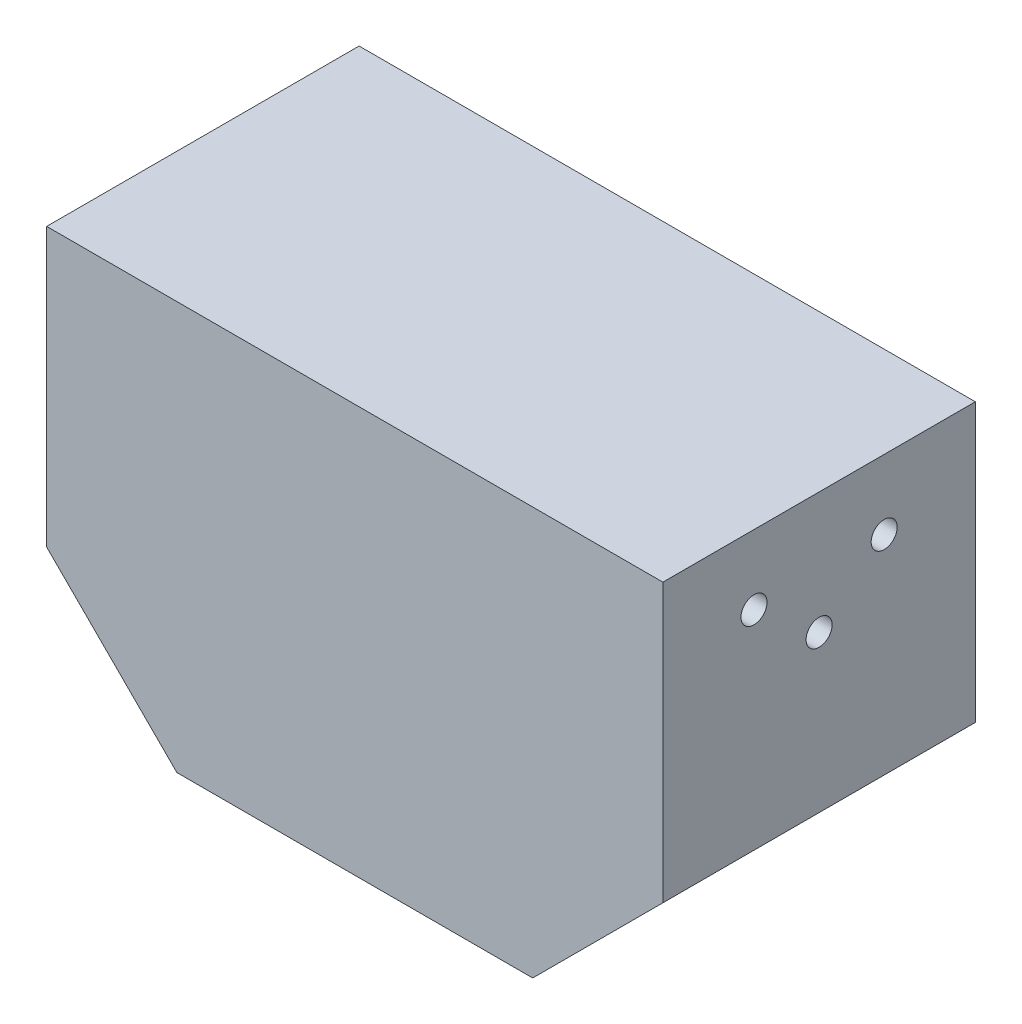
ISO-10303-21;
HEADER;
FILE_DESCRIPTION(('STEP AP214'),'2;1');
FILE_NAME('part.step','',(''),(''),'','','');
FILE_SCHEMA(('AUTOMOTIVE_DESIGN { 1 0 10303 214 1 1 1 1 }'));
ENDSEC;
DATA;
#1=APPLICATION_CONTEXT('core data for automotive mechanical design processes');
#2=APPLICATION_PROTOCOL_DEFINITION('international standard','automotive_design',2000,#1);
#3=PRODUCT_CONTEXT('',#1,'mechanical');
#4=PRODUCT('Part','Part','',(#3));
#5=PRODUCT_RELATED_PRODUCT_CATEGORY('part','',(#4));
#6=PRODUCT_DEFINITION_FORMATION('','',#4);
#7=PRODUCT_DEFINITION_CONTEXT('part definition',#1,'design');
#8=PRODUCT_DEFINITION('design','',#6,#7);
#9=PRODUCT_DEFINITION_SHAPE('','',#8);
#10=(LENGTH_UNIT() NAMED_UNIT(*) SI_UNIT(.MILLI.,.METRE.));
#11=(NAMED_UNIT(*) PLANE_ANGLE_UNIT() SI_UNIT($,.RADIAN.));
#12=(NAMED_UNIT(*) SI_UNIT($,.STERADIAN.) SOLID_ANGLE_UNIT());
#13=UNCERTAINTY_MEASURE_WITH_UNIT(LENGTH_MEASURE(1.E-05),#10,'distance_accuracy_value','');
#14=(GEOMETRIC_REPRESENTATION_CONTEXT(3) GLOBAL_UNCERTAINTY_ASSIGNED_CONTEXT((#13)) GLOBAL_UNIT_ASSIGNED_CONTEXT((#10,
#11,#12)) REPRESENTATION_CONTEXT('',''));
#15=CARTESIAN_POINT('',(0.,0.,0.));
#16=DIRECTION('',(0.,0.,1.));
#17=DIRECTION('',(1.,0.,0.));
#18=AXIS2_PLACEMENT_3D('',#15,#16,#17);
#19=CARTESIAN_POINT('',(-35.5,47.,-18.));
#20=DIRECTION('',(0.,0.,1.));
#21=DIRECTION('',(1.,0.,0.));
#22=AXIS2_PLACEMENT_3D('',#19,#20,#21);
#23=PLANE('',#22);
#24=DIRECTION('',(0.,-1.,0.));
#25=VECTOR('',#24,1.);
#26=CARTESIAN_POINT('',(35.5,47.,-18.));
#27=LINE('',#26,#25);
#28=CARTESIAN_POINT('',(35.5,47.,-18.));
#29=VERTEX_POINT('',#28);
#30=CARTESIAN_POINT('',(35.5,15.,-18.));
#31=VERTEX_POINT('',#30);
#32=EDGE_CURVE('E11',#29,#31,#27,.T.);
#33=ORIENTED_EDGE('',*,*,#32,.T.);
#34=DIRECTION('',(-0.707106781186547,-0.707106781186548,0.));
#35=VECTOR('',#34,1.);
#36=CARTESIAN_POINT('',(10.25,-10.25,-18.));
#37=LINE('',#36,#35);
#38=CARTESIAN_POINT('',(20.5,0.,-18.));
#39=VERTEX_POINT('',#38);
#40=EDGE_CURVE('E53',#31,#39,#37,.T.);
#41=ORIENTED_EDGE('',*,*,#40,.T.);
#42=DIRECTION('',(-1.,0.,0.));
#43=VECTOR('',#42,1.);
#44=CARTESIAN_POINT('',(-35.5,0.,-18.));
#45=LINE('',#44,#43);
#46=CARTESIAN_POINT('',(-20.5,0.,-18.));
#47=VERTEX_POINT('',#46);
#48=EDGE_CURVE('E60',#39,#47,#45,.T.);
#49=ORIENTED_EDGE('',*,*,#48,.T.);
#50=DIRECTION('',(0.707106781186548,-0.707106781186548,0.));
#51=VECTOR('',#50,1.);
#52=CARTESIAN_POINT('',(-10.25,-10.25,-18.));
#53=LINE('',#52,#51);
#54=CARTESIAN_POINT('',(-35.5,15.,-18.));
#55=VERTEX_POINT('',#54);
#56=EDGE_CURVE('E130',#55,#47,#53,.T.);
#57=ORIENTED_EDGE('',*,*,#56,.F.);
#58=DIRECTION('',(0.,-1.,0.));
#59=VECTOR('',#58,1.);
#60=CARTESIAN_POINT('',(-35.5,47.,-18.));
#61=LINE('',#60,#59);
#62=CARTESIAN_POINT('',(-35.5,47.,-18.));
#63=VERTEX_POINT('',#62);
#64=EDGE_CURVE('E46',#63,#55,#61,.T.);
#65=ORIENTED_EDGE('',*,*,#64,.F.);
#66=DIRECTION('',(-1.,0.,0.));
#67=VECTOR('',#66,1.);
#68=CARTESIAN_POINT('',(-35.5,47.,-18.));
#69=LINE('',#68,#67);
#70=EDGE_CURVE('E128',#29,#63,#69,.T.);
#71=ORIENTED_EDGE('',*,*,#70,.F.);
#72=EDGE_LOOP('',(#33,#41,#49,#57,#65,#71));
#73=FACE_BOUND('',#72,.T.);
#74=ADVANCED_FACE('F38',(#73),#23,.F.);
#75=CARTESIAN_POINT('',(-35.5,47.,18.));
#76=DIRECTION('',(1.,0.,0.));
#77=DIRECTION('',(0.,0.,-1.));
#78=AXIS2_PLACEMENT_3D('',#75,#76,#77);
#79=PLANE('',#78);
#80=CARTESIAN_POINT('',(-35.5,39.,-7.5));
#81=DIRECTION('',(1.,0.,0.));
#82=DIRECTION('',(0.,0.,-1.));
#83=AXIS2_PLACEMENT_3D('',#80,#81,#82);
#84=CIRCLE('',#83,1.5);
#85=CARTESIAN_POINT('',(-35.5,39.,-9.));
#86=VERTEX_POINT('',#85);
#87=EDGE_CURVE('E224',#86,#86,#84,.T.);
#88=ORIENTED_EDGE('',*,*,#87,.T.);
#89=EDGE_LOOP('',(#88));
#90=FACE_BOUND('',#89,.T.);
#91=CARTESIAN_POINT('',(-35.5,33.,0.));
#92=DIRECTION('',(1.,0.,0.));
#93=DIRECTION('',(0.,0.,-1.));
#94=AXIS2_PLACEMENT_3D('',#91,#92,#93);
#95=CIRCLE('',#94,1.5);
#96=CARTESIAN_POINT('',(-35.5,33.,-1.5));
#97=VERTEX_POINT('',#96);
#98=EDGE_CURVE('E235',#97,#97,#95,.T.);
#99=ORIENTED_EDGE('',*,*,#98,.T.);
#100=EDGE_LOOP('',(#99));
#101=FACE_BOUND('',#100,.T.);
#102=CARTESIAN_POINT('',(-35.5,39.,7.5));
#103=DIRECTION('',(1.,0.,0.));
#104=DIRECTION('',(0.,0.,-1.));
#105=AXIS2_PLACEMENT_3D('',#102,#103,#104);
#106=CIRCLE('',#105,1.5);
#107=CARTESIAN_POINT('',(-35.5,39.,6.));
#108=VERTEX_POINT('',#107);
#109=EDGE_CURVE('E223',#108,#108,#106,.T.);
#110=ORIENTED_EDGE('',*,*,#109,.T.);
#111=EDGE_LOOP('',(#110));
#112=FACE_BOUND('',#111,.T.);
#113=DIRECTION('',(0.,0.,1.));
#114=VECTOR('',#113,1.);
#115=CARTESIAN_POINT('',(-35.5,15.,-18.));
#116=LINE('',#115,#114);
#117=CARTESIAN_POINT('',(-35.5,15.,18.));
#118=VERTEX_POINT('',#117);
#119=EDGE_CURVE('E109',#55,#118,#116,.T.);
#120=ORIENTED_EDGE('',*,*,#119,.T.);
#121=DIRECTION('',(0.,-1.,0.));
#122=VECTOR('',#121,1.);
#123=CARTESIAN_POINT('',(-35.5,47.,18.));
#124=LINE('',#123,#122);
#125=CARTESIAN_POINT('',(-35.5,47.,18.));
#126=VERTEX_POINT('',#125);
#127=EDGE_CURVE('E118',#126,#118,#124,.T.);
#128=ORIENTED_EDGE('',*,*,#127,.F.);
#129=DIRECTION('',(0.,0.,1.));
#130=VECTOR('',#129,1.);
#131=CARTESIAN_POINT('',(-35.5,47.,18.));
#132=LINE('',#131,#130);
#133=EDGE_CURVE('E127',#63,#126,#132,.T.);
#134=ORIENTED_EDGE('',*,*,#133,.F.);
#135=ORIENTED_EDGE('',*,*,#64,.T.);
#136=EDGE_LOOP('',(#120,#128,#134,#135));
#137=FACE_BOUND('',#136,.T.);
#138=ADVANCED_FACE('F125',(#90,#101,#112,#137),#79,.F.);
#139=CARTESIAN_POINT('',(-35.5,47.,18.));
#140=DIRECTION('',(0.,0.,-1.));
#141=DIRECTION('',(-1.,0.,0.));
#142=AXIS2_PLACEMENT_3D('',#139,#140,#141);
#143=PLANE('',#142);
#144=DIRECTION('',(1.,0.,0.));
#145=VECTOR('',#144,1.);
#146=CARTESIAN_POINT('',(-35.5,0.,18.));
#147=LINE('',#146,#145);
#148=CARTESIAN_POINT('',(-20.5,0.,18.));
#149=VERTEX_POINT('',#148);
#150=CARTESIAN_POINT('',(20.5,0.,18.));
#151=VERTEX_POINT('',#150);
#152=EDGE_CURVE('E105',#149,#151,#147,.T.);
#153=ORIENTED_EDGE('',*,*,#152,.T.);
#154=DIRECTION('',(-0.707106781186547,-0.707106781186548,0.));
#155=VECTOR('',#154,1.);
#156=CARTESIAN_POINT('',(10.25,-10.25,18.));
#157=LINE('',#156,#155);
#158=CARTESIAN_POINT('',(35.5,15.,18.));
#159=VERTEX_POINT('',#158);
#160=EDGE_CURVE('E93',#159,#151,#157,.T.);
#161=ORIENTED_EDGE('',*,*,#160,.F.);
#162=DIRECTION('',(0.,-1.,0.));
#163=VECTOR('',#162,1.);
#164=CARTESIAN_POINT('',(35.5,47.,18.));
#165=LINE('',#164,#163);
#166=CARTESIAN_POINT('',(35.5,47.,18.));
#167=VERTEX_POINT('',#166);
#168=EDGE_CURVE('E115',#167,#159,#165,.T.);
#169=ORIENTED_EDGE('',*,*,#168,.F.);
#170=DIRECTION('',(1.,0.,0.));
#171=VECTOR('',#170,1.);
#172=CARTESIAN_POINT('',(-35.5,47.,18.));
#173=LINE('',#172,#171);
#174=EDGE_CURVE('E112',#126,#167,#173,.T.);
#175=ORIENTED_EDGE('',*,*,#174,.F.);
#176=ORIENTED_EDGE('',*,*,#127,.T.);
#177=DIRECTION('',(0.707106781186548,-0.707106781186548,0.));
#178=VECTOR('',#177,1.);
#179=CARTESIAN_POINT('',(-10.25,-10.25,18.));
#180=LINE('',#179,#178);
#181=EDGE_CURVE('E97',#118,#149,#180,.T.);
#182=ORIENTED_EDGE('',*,*,#181,.T.);
#183=EDGE_LOOP('',(#153,#161,#169,#175,#176,#182));
#184=FACE_BOUND('',#183,.T.);
#185=ADVANCED_FACE('F145',(#184),#143,.F.);
#186=CARTESIAN_POINT('',(0.,0.,0.));
#187=DIRECTION('',(0.,-1.,0.));
#188=DIRECTION('',(0.,0.,-1.));
#189=AXIS2_PLACEMENT_3D('',#186,#187,#188);
#190=PLANE('',#189);
#191=DIRECTION('',(0.,0.,1.));
#192=VECTOR('',#191,1.);
#193=CARTESIAN_POINT('',(20.5,0.,-18.));
#194=LINE('',#193,#192);
#195=EDGE_CURVE('E90',#39,#151,#194,.T.);
#196=ORIENTED_EDGE('',*,*,#195,.T.);
#197=ORIENTED_EDGE('',*,*,#152,.F.);
#198=DIRECTION('',(0.,0.,1.));
#199=VECTOR('',#198,1.);
#200=CARTESIAN_POINT('',(-20.5,0.,-18.));
#201=LINE('',#200,#199);
#202=EDGE_CURVE('E104',#47,#149,#201,.T.);
#203=ORIENTED_EDGE('',*,*,#202,.F.);
#204=ORIENTED_EDGE('',*,*,#48,.F.);
#205=EDGE_LOOP('',(#196,#197,#203,#204));
#206=FACE_BOUND('',#205,.T.);
#207=ADVANCED_FACE('F103',(#206),#190,.T.);
#208=CARTESIAN_POINT('',(35.5,47.,18.));
#209=DIRECTION('',(-1.,0.,0.));
#210=DIRECTION('',(0.,0.,1.));
#211=AXIS2_PLACEMENT_3D('',#208,#209,#210);
#212=PLANE('',#211);
#213=CARTESIAN_POINT('',(35.5,39.,-7.5));
#214=DIRECTION('',(1.,0.,0.));
#215=DIRECTION('',(0.,0.,-1.));
#216=AXIS2_PLACEMENT_3D('',#213,#214,#215);
#217=CIRCLE('',#216,1.5);
#218=CARTESIAN_POINT('',(35.5,39.,-9.));
#219=VERTEX_POINT('',#218);
#220=EDGE_CURVE('E245',#219,#219,#217,.T.);
#221=ORIENTED_EDGE('',*,*,#220,.F.);
#222=EDGE_LOOP('',(#221));
#223=FACE_BOUND('',#222,.T.);
#224=CARTESIAN_POINT('',(35.5,33.,0.));
#225=DIRECTION('',(1.,0.,0.));
#226=DIRECTION('',(0.,0.,-1.));
#227=AXIS2_PLACEMENT_3D('',#224,#225,#226);
#228=CIRCLE('',#227,1.5);
#229=CARTESIAN_POINT('',(35.5,33.,-1.5));
#230=VERTEX_POINT('',#229);
#231=EDGE_CURVE('E239',#230,#230,#228,.T.);
#232=ORIENTED_EDGE('',*,*,#231,.F.);
#233=EDGE_LOOP('',(#232));
#234=FACE_BOUND('',#233,.T.);
#235=CARTESIAN_POINT('',(35.5,39.,7.5));
#236=DIRECTION('',(1.,0.,0.));
#237=DIRECTION('',(0.,0.,-1.));
#238=AXIS2_PLACEMENT_3D('',#235,#236,#237);
#239=CIRCLE('',#238,1.5);
#240=CARTESIAN_POINT('',(35.5,39.,6.));
#241=VERTEX_POINT('',#240);
#242=EDGE_CURVE('E244',#241,#241,#239,.T.);
#243=ORIENTED_EDGE('',*,*,#242,.F.);
#244=EDGE_LOOP('',(#243));
#245=FACE_BOUND('',#244,.T.);
#246=ORIENTED_EDGE('',*,*,#168,.T.);
#247=DIRECTION('',(0.,0.,1.));
#248=VECTOR('',#247,1.);
#249=CARTESIAN_POINT('',(35.5,15.,-18.));
#250=LINE('',#249,#248);
#251=EDGE_CURVE('E98',#31,#159,#250,.T.);
#252=ORIENTED_EDGE('',*,*,#251,.F.);
#253=ORIENTED_EDGE('',*,*,#32,.F.);
#254=DIRECTION('',(0.,0.,-1.));
#255=VECTOR('',#254,1.);
#256=CARTESIAN_POINT('',(35.5,47.,18.));
#257=LINE('',#256,#255);
#258=EDGE_CURVE('E107',#167,#29,#257,.T.);
#259=ORIENTED_EDGE('',*,*,#258,.F.);
#260=EDGE_LOOP('',(#246,#252,#253,#259));
#261=FACE_BOUND('',#260,.T.);
#262=ADVANCED_FACE('F40',(#223,#234,#245,#261),#212,.F.);
#263=CARTESIAN_POINT('',(0.,47.,0.));
#264=DIRECTION('',(0.,-1.,0.));
#265=DIRECTION('',(0.,0.,-1.));
#266=AXIS2_PLACEMENT_3D('',#263,#264,#265);
#267=PLANE('',#266);
#268=ORIENTED_EDGE('',*,*,#258,.T.);
#269=ORIENTED_EDGE('',*,*,#70,.T.);
#270=ORIENTED_EDGE('',*,*,#133,.T.);
#271=ORIENTED_EDGE('',*,*,#174,.T.);
#272=EDGE_LOOP('',(#268,#269,#270,#271));
#273=FACE_BOUND('',#272,.T.);
#274=ADVANCED_FACE('F142',(#273),#267,.F.);
#275=CARTESIAN_POINT('',(-10.25,-10.25,-18.));
#276=DIRECTION('',(-0.707106781186547,-0.707106781186547,0.));
#277=DIRECTION('',(0.707106781186548,-0.707106781186548,0.));
#278=AXIS2_PLACEMENT_3D('',#275,#276,#277);
#279=PLANE('',#278);
#280=ORIENTED_EDGE('',*,*,#181,.F.);
#281=ORIENTED_EDGE('',*,*,#119,.F.);
#282=ORIENTED_EDGE('',*,*,#56,.T.);
#283=ORIENTED_EDGE('',*,*,#202,.T.);
#284=EDGE_LOOP('',(#280,#281,#282,#283));
#285=FACE_BOUND('',#284,.T.);
#286=ADVANCED_FACE('F153',(#285),#279,.T.);
#287=CARTESIAN_POINT('',(10.25,-10.25,-18.));
#288=DIRECTION('',(-0.707106781186548,0.707106781186547,0.));
#289=DIRECTION('',(-0.707106781186547,-0.707106781186548,0.));
#290=AXIS2_PLACEMENT_3D('',#287,#288,#289);
#291=PLANE('',#290);
#292=ORIENTED_EDGE('',*,*,#160,.T.);
#293=ORIENTED_EDGE('',*,*,#195,.F.);
#294=ORIENTED_EDGE('',*,*,#40,.F.);
#295=ORIENTED_EDGE('',*,*,#251,.T.);
#296=EDGE_LOOP('',(#292,#293,#294,#295));
#297=FACE_BOUND('',#296,.T.);
#298=ADVANCED_FACE('F91',(#297),#291,.F.);
#299=CARTESIAN_POINT('',(15.5,39.,7.5));
#300=DIRECTION('',(1.,0.,0.));
#301=DIRECTION('',(0.,0.,-1.));
#302=AXIS2_PLACEMENT_3D('',#299,#300,#301);
#303=CYLINDRICAL_SURFACE('',#302,1.5);
#304=CARTESIAN_POINT('',(15.5,39.,7.5));
#305=DIRECTION('',(1.,0.,0.));
#306=DIRECTION('',(0.,0.,-1.));
#307=AXIS2_PLACEMENT_3D('',#304,#305,#306);
#308=CIRCLE('',#307,1.5);
#309=CARTESIAN_POINT('',(15.5,39.,6.));
#310=VERTEX_POINT('',#309);
#311=EDGE_CURVE('E253',#310,#310,#308,.T.);
#312=ORIENTED_EDGE('',*,*,#311,.F.);
#313=EDGE_LOOP('',(#312));
#314=FACE_BOUND('',#313,.T.);
#315=ORIENTED_EDGE('',*,*,#242,.T.);
#316=EDGE_LOOP('',(#315));
#317=FACE_BOUND('',#316,.T.);
#318=ADVANCED_FACE('F171',(#314,#317),#303,.F.);
#319=CARTESIAN_POINT('',(15.5,39.,7.5));
#320=DIRECTION('',(1.,0.,0.));
#321=DIRECTION('',(0.,0.,-1.));
#322=AXIS2_PLACEMENT_3D('',#319,#320,#321);
#323=PLANE('',#322);
#324=ORIENTED_EDGE('',*,*,#311,.T.);
#325=EDGE_LOOP('',(#324));
#326=FACE_BOUND('',#325,.T.);
#327=ADVANCED_FACE('F174',(#326),#323,.T.);
#328=CARTESIAN_POINT('',(15.5,33.,0.));
#329=DIRECTION('',(1.,0.,0.));
#330=DIRECTION('',(0.,0.,-1.));
#331=AXIS2_PLACEMENT_3D('',#328,#329,#330);
#332=CYLINDRICAL_SURFACE('',#331,1.5);
#333=CARTESIAN_POINT('',(15.5,33.,0.));
#334=DIRECTION('',(1.,0.,0.));
#335=DIRECTION('',(0.,0.,-1.));
#336=AXIS2_PLACEMENT_3D('',#333,#334,#335);
#337=CIRCLE('',#336,1.5);
#338=CARTESIAN_POINT('',(15.5,33.,-1.5));
#339=VERTEX_POINT('',#338);
#340=EDGE_CURVE('E248',#339,#339,#337,.T.);
#341=ORIENTED_EDGE('',*,*,#340,.F.);
#342=EDGE_LOOP('',(#341));
#343=FACE_BOUND('',#342,.T.);
#344=ORIENTED_EDGE('',*,*,#231,.T.);
#345=EDGE_LOOP('',(#344));
#346=FACE_BOUND('',#345,.T.);
#347=ADVANCED_FACE('F178',(#343,#346),#332,.F.);
#348=CARTESIAN_POINT('',(15.5,33.,0.));
#349=DIRECTION('',(1.,0.,0.));
#350=DIRECTION('',(0.,0.,-1.));
#351=AXIS2_PLACEMENT_3D('',#348,#349,#350);
#352=PLANE('',#351);
#353=ORIENTED_EDGE('',*,*,#340,.T.);
#354=EDGE_LOOP('',(#353));
#355=FACE_BOUND('',#354,.T.);
#356=ADVANCED_FACE('F182',(#355),#352,.T.);
#357=CARTESIAN_POINT('',(15.5,39.,-7.5));
#358=DIRECTION('',(1.,0.,0.));
#359=DIRECTION('',(0.,0.,-1.));
#360=AXIS2_PLACEMENT_3D('',#357,#358,#359);
#361=CYLINDRICAL_SURFACE('',#360,1.5);
#362=CARTESIAN_POINT('',(15.5,39.,-7.5));
#363=DIRECTION('',(1.,0.,0.));
#364=DIRECTION('',(0.,0.,-1.));
#365=AXIS2_PLACEMENT_3D('',#362,#363,#364);
#366=CIRCLE('',#365,1.5);
#367=CARTESIAN_POINT('',(15.5,39.,-9.));
#368=VERTEX_POINT('',#367);
#369=EDGE_CURVE('E241',#368,#368,#366,.T.);
#370=ORIENTED_EDGE('',*,*,#369,.F.);
#371=EDGE_LOOP('',(#370));
#372=FACE_BOUND('',#371,.T.);
#373=ORIENTED_EDGE('',*,*,#220,.T.);
#374=EDGE_LOOP('',(#373));
#375=FACE_BOUND('',#374,.T.);
#376=ADVANCED_FACE('F186',(#372,#375),#361,.F.);
#377=CARTESIAN_POINT('',(15.5,39.,-7.5));
#378=DIRECTION('',(1.,0.,0.));
#379=DIRECTION('',(0.,0.,-1.));
#380=AXIS2_PLACEMENT_3D('',#377,#378,#379);
#381=PLANE('',#380);
#382=ORIENTED_EDGE('',*,*,#369,.T.);
#383=EDGE_LOOP('',(#382));
#384=FACE_BOUND('',#383,.T.);
#385=ADVANCED_FACE('F190',(#384),#381,.T.);
#386=CARTESIAN_POINT('',(-15.5,39.,7.5));
#387=DIRECTION('',(-1.,0.,0.));
#388=DIRECTION('',(0.,0.,1.));
#389=AXIS2_PLACEMENT_3D('',#386,#387,#388);
#390=CYLINDRICAL_SURFACE('',#389,1.5);
#391=CARTESIAN_POINT('',(-15.5,39.,7.5));
#392=DIRECTION('',(1.,0.,0.));
#393=DIRECTION('',(0.,0.,-1.));
#394=AXIS2_PLACEMENT_3D('',#391,#392,#393);
#395=CIRCLE('',#394,1.5);
#396=CARTESIAN_POINT('',(-15.5,39.,6.));
#397=VERTEX_POINT('',#396);
#398=EDGE_CURVE('E227',#397,#397,#395,.T.);
#399=ORIENTED_EDGE('',*,*,#398,.T.);
#400=EDGE_LOOP('',(#399));
#401=FACE_BOUND('',#400,.T.);
#402=ORIENTED_EDGE('',*,*,#109,.F.);
#403=EDGE_LOOP('',(#402));
#404=FACE_BOUND('',#403,.T.);
#405=ADVANCED_FACE('F194',(#401,#404),#390,.F.);
#406=CARTESIAN_POINT('',(-15.5,39.,7.5));
#407=DIRECTION('',(-1.,0.,0.));
#408=DIRECTION('',(0.,0.,-1.));
#409=AXIS2_PLACEMENT_3D('',#406,#407,#408);
#410=PLANE('',#409);
#411=ORIENTED_EDGE('',*,*,#398,.F.);
#412=EDGE_LOOP('',(#411));
#413=FACE_BOUND('',#412,.T.);
#414=ADVANCED_FACE('F198',(#413),#410,.T.);
#415=CARTESIAN_POINT('',(-15.5,33.,0.));
#416=DIRECTION('',(-1.,0.,0.));
#417=DIRECTION('',(0.,0.,1.));
#418=AXIS2_PLACEMENT_3D('',#415,#416,#417);
#419=CYLINDRICAL_SURFACE('',#418,1.5);
#420=CARTESIAN_POINT('',(-15.5,33.,0.));
#421=DIRECTION('',(1.,0.,0.));
#422=DIRECTION('',(0.,0.,-1.));
#423=AXIS2_PLACEMENT_3D('',#420,#421,#422);
#424=CIRCLE('',#423,1.5);
#425=CARTESIAN_POINT('',(-15.5,33.,-1.5));
#426=VERTEX_POINT('',#425);
#427=EDGE_CURVE('E230',#426,#426,#424,.T.);
#428=ORIENTED_EDGE('',*,*,#427,.T.);
#429=EDGE_LOOP('',(#428));
#430=FACE_BOUND('',#429,.T.);
#431=ORIENTED_EDGE('',*,*,#98,.F.);
#432=EDGE_LOOP('',(#431));
#433=FACE_BOUND('',#432,.T.);
#434=ADVANCED_FACE('F202',(#430,#433),#419,.F.);
#435=CARTESIAN_POINT('',(-15.5,33.,0.));
#436=DIRECTION('',(-1.,0.,0.));
#437=DIRECTION('',(0.,0.,-1.));
#438=AXIS2_PLACEMENT_3D('',#435,#436,#437);
#439=PLANE('',#438);
#440=ORIENTED_EDGE('',*,*,#427,.F.);
#441=EDGE_LOOP('',(#440));
#442=FACE_BOUND('',#441,.T.);
#443=ADVANCED_FACE('F206',(#442),#439,.T.);
#444=CARTESIAN_POINT('',(-15.5,39.,-7.5));
#445=DIRECTION('',(-1.,0.,0.));
#446=DIRECTION('',(0.,0.,1.));
#447=AXIS2_PLACEMENT_3D('',#444,#445,#446);
#448=CYLINDRICAL_SURFACE('',#447,1.5);
#449=CARTESIAN_POINT('',(-15.5,39.,-7.5));
#450=DIRECTION('',(1.,0.,0.));
#451=DIRECTION('',(0.,0.,-1.));
#452=AXIS2_PLACEMENT_3D('',#449,#450,#451);
#453=CIRCLE('',#452,1.5);
#454=CARTESIAN_POINT('',(-15.5,39.,-9.));
#455=VERTEX_POINT('',#454);
#456=EDGE_CURVE('E222',#455,#455,#453,.T.);
#457=ORIENTED_EDGE('',*,*,#456,.T.);
#458=EDGE_LOOP('',(#457));
#459=FACE_BOUND('',#458,.T.);
#460=ORIENTED_EDGE('',*,*,#87,.F.);
#461=EDGE_LOOP('',(#460));
#462=FACE_BOUND('',#461,.T.);
#463=ADVANCED_FACE('F210',(#459,#462),#448,.F.);
#464=CARTESIAN_POINT('',(-15.5,39.,-7.5));
#465=DIRECTION('',(-1.,0.,0.));
#466=DIRECTION('',(0.,0.,-1.));
#467=AXIS2_PLACEMENT_3D('',#464,#465,#466);
#468=PLANE('',#467);
#469=ORIENTED_EDGE('',*,*,#456,.F.);
#470=EDGE_LOOP('',(#469));
#471=FACE_BOUND('',#470,.T.);
#472=ADVANCED_FACE('F214',(#471),#468,.T.);
#473=CLOSED_SHELL('',(#74,#138,#185,#207,#262,#274,#286,#298,#318,#327,#347,#356,#376,#385,#405,
#414,#434,#443,#463,#472));
#474=MANIFOLD_SOLID_BREP('B2',#473);
#475=ADVANCED_BREP_SHAPE_REPRESENTATION('',(#18,#474),#14);
#476=SHAPE_DEFINITION_REPRESENTATION(#9,#475);
ENDSEC;
END-ISO-10303-21;
